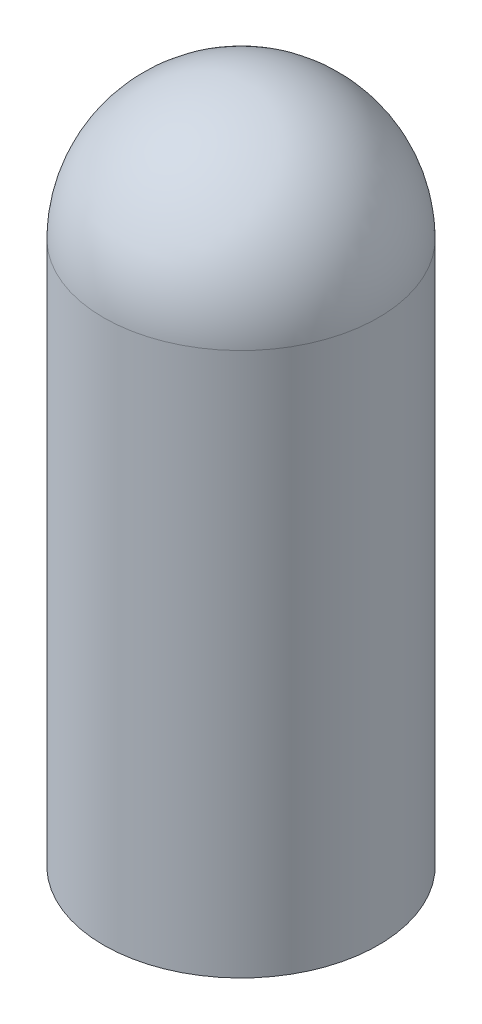
ISO-10303-21;
HEADER;
FILE_DESCRIPTION(('STEP AP214'),'2;1');
FILE_NAME('part.step','',(''),(''),'','','');
FILE_SCHEMA(('AUTOMOTIVE_DESIGN { 1 0 10303 214 1 1 1 1 }'));
ENDSEC;
DATA;
#1=APPLICATION_CONTEXT('core data for automotive mechanical design processes');
#2=APPLICATION_PROTOCOL_DEFINITION('international standard','automotive_design',2000,#1);
#3=PRODUCT_CONTEXT('',#1,'mechanical');
#4=PRODUCT('Part','Part','',(#3));
#5=PRODUCT_RELATED_PRODUCT_CATEGORY('part','',(#4));
#6=PRODUCT_DEFINITION_FORMATION('','',#4);
#7=PRODUCT_DEFINITION_CONTEXT('part definition',#1,'design');
#8=PRODUCT_DEFINITION('design','',#6,#7);
#9=PRODUCT_DEFINITION_SHAPE('','',#8);
#10=(LENGTH_UNIT() NAMED_UNIT(*) SI_UNIT(.MILLI.,.METRE.));
#11=(NAMED_UNIT(*) PLANE_ANGLE_UNIT() SI_UNIT($,.RADIAN.));
#12=(NAMED_UNIT(*) SI_UNIT($,.STERADIAN.) SOLID_ANGLE_UNIT());
#13=UNCERTAINTY_MEASURE_WITH_UNIT(LENGTH_MEASURE(1.E-05),#10,'distance_accuracy_value','');
#14=(GEOMETRIC_REPRESENTATION_CONTEXT(3) GLOBAL_UNCERTAINTY_ASSIGNED_CONTEXT((#13)) GLOBAL_UNIT_ASSIGNED_CONTEXT((#10,
#11,#12)) REPRESENTATION_CONTEXT('',''));
#15=CARTESIAN_POINT('',(0.,0.,0.));
#16=DIRECTION('',(0.,0.,1.));
#17=DIRECTION('',(1.,0.,0.));
#18=AXIS2_PLACEMENT_3D('',#15,#16,#17);
#19=CARTESIAN_POINT('',(0.,203.2,0.));
#20=DIRECTION('',(0.,-1.,0.));
#21=DIRECTION('',(0.,0.,-1.));
#22=AXIS2_PLACEMENT_3D('',#19,#20,#21);
#23=CYLINDRICAL_SURFACE('',#22,51.3588);
#24=CARTESIAN_POINT('',(0.,203.2,0.));
#25=DIRECTION('',(0.,1.,0.));
#26=DIRECTION('',(0.,0.,1.));
#27=AXIS2_PLACEMENT_3D('',#24,#25,#26);
#28=CIRCLE('',#27,51.3588);
#29=CARTESIAN_POINT('',(0.,203.2,51.3588));
#30=VERTEX_POINT('',#29);
#31=EDGE_CURVE('E10',#30,#30,#28,.T.);
#32=ORIENTED_EDGE('',*,*,#31,.F.);
#33=EDGE_LOOP('',(#32));
#34=FACE_BOUND('',#33,.T.);
#35=CARTESIAN_POINT('',(0.,0.,0.));
#36=DIRECTION('',(0.,1.,0.));
#37=DIRECTION('',(0.,0.,1.));
#38=AXIS2_PLACEMENT_3D('',#35,#36,#37);
#39=CIRCLE('',#38,51.3588);
#40=CARTESIAN_POINT('',(0.,0.,51.3588));
#41=VERTEX_POINT('',#40);
#42=EDGE_CURVE('E38',#41,#41,#39,.T.);
#43=ORIENTED_EDGE('',*,*,#42,.T.);
#44=EDGE_LOOP('',(#43));
#45=FACE_BOUND('',#44,.T.);
#46=ADVANCED_FACE('F31',(#34,#45),#23,.T.);
#47=CARTESIAN_POINT('',(0.,202.6381266,0.));
#48=DIRECTION('',(0.,0.,1.));
#49=DIRECTION('',(1.,0.,0.));
#50=AXIS2_PLACEMENT_3D('',#47,#48,#49);
#51=SPHERICAL_SURFACE('',#50,51.3618734);
#52=CARTESIAN_POINT('',(0.,202.6381266,0.));
#53=DIRECTION('',(0.,1.,0.));
#54=DIRECTION('',(0.,0.,1.));
#55=AXIS2_PLACEMENT_3D('',#52,#53,#54);
#56=SPHERICAL_SURFACE('',#55,51.3618734);
#57=ORIENTED_EDGE('',*,*,#31,.T.);
#58=EDGE_LOOP('',(#57));
#59=FACE_BOUND('',#58,.T.);
#60=ADVANCED_FACE('F33',(#59),#56,.T.);
#61=CARTESIAN_POINT('',(0.,0.,0.));
#62=DIRECTION('',(0.,1.,0.));
#63=DIRECTION('',(0.,0.,1.));
#64=AXIS2_PLACEMENT_3D('',#61,#62,#63);
#65=PLANE('',#64);
#66=CARTESIAN_POINT('',(0.,0.,0.));
#67=DIRECTION('',(0.,1.,0.));
#68=DIRECTION('',(0.,0.,1.));
#69=AXIS2_PLACEMENT_3D('',#66,#67,#68);
#70=CIRCLE('',#69,50.8);
#71=CARTESIAN_POINT('',(0.,0.,50.8));
#72=VERTEX_POINT('',#71);
#73=EDGE_CURVE('E46',#72,#72,#70,.T.);
#74=ORIENTED_EDGE('',*,*,#73,.T.);
#75=EDGE_LOOP('',(#74));
#76=FACE_BOUND('',#75,.T.);
#77=ORIENTED_EDGE('',*,*,#42,.F.);
#78=EDGE_LOOP('',(#77));
#79=FACE_BOUND('',#78,.T.);
#80=ADVANCED_FACE('F52',(#76,#79),#65,.F.);
#81=CARTESIAN_POINT('',(0.,203.2,0.));
#82=DIRECTION('',(0.,-1.,0.));
#83=DIRECTION('',(0.,0.,-1.));
#84=AXIS2_PLACEMENT_3D('',#81,#82,#83);
#85=CYLINDRICAL_SURFACE('',#84,50.8);
#86=CARTESIAN_POINT('',(0.,203.196935051786,0.));
#87=DIRECTION('',(0.,-1.00000000000001,0.));
#88=DIRECTION('',(0.,0.,-1.));
#89=AXIS2_PLACEMENT_3D('',#86,#87,#88);
#90=CIRCLE('',#89,50.8);
#91=CARTESIAN_POINT('',(0.,203.196935051786,-50.8));
#92=VERTEX_POINT('',#91);
#93=EDGE_CURVE('E42',#92,#92,#90,.F.);
#94=ORIENTED_EDGE('',*,*,#93,.T.);
#95=EDGE_LOOP('',(#94));
#96=FACE_BOUND('',#95,.T.);
#97=ORIENTED_EDGE('',*,*,#73,.F.);
#98=EDGE_LOOP('',(#97));
#99=FACE_BOUND('',#98,.T.);
#100=ADVANCED_FACE('F55',(#96,#99),#85,.F.);
#101=CARTESIAN_POINT('',(0.,202.6381266,0.));
#102=DIRECTION('',(0.,0.,1.));
#103=DIRECTION('',(1.,0.,0.));
#104=AXIS2_PLACEMENT_3D('',#101,#102,#103);
#105=SPHERICAL_SURFACE('',#104,50.8030734);
#106=CARTESIAN_POINT('',(0.,202.6381266,0.));
#107=DIRECTION('',(0.,-1.,0.));
#108=DIRECTION('',(0.,0.,-1.));
#109=AXIS2_PLACEMENT_3D('',#106,#107,#108);
#110=SPHERICAL_SURFACE('',#109,50.8030734);
#111=ORIENTED_EDGE('',*,*,#93,.F.);
#112=EDGE_LOOP('',(#111));
#113=FACE_BOUND('',#112,.T.);
#114=ADVANCED_FACE('F57',(#113),#110,.F.);
#115=CLOSED_SHELL('',(#46,#60,#80,#100,#114));
#116=MANIFOLD_SOLID_BREP('B2',#115);
#117=ADVANCED_BREP_SHAPE_REPRESENTATION('',(#18,#116),#14);
#118=SHAPE_DEFINITION_REPRESENTATION(#9,#117);
ENDSEC;
END-ISO-10303-21;
